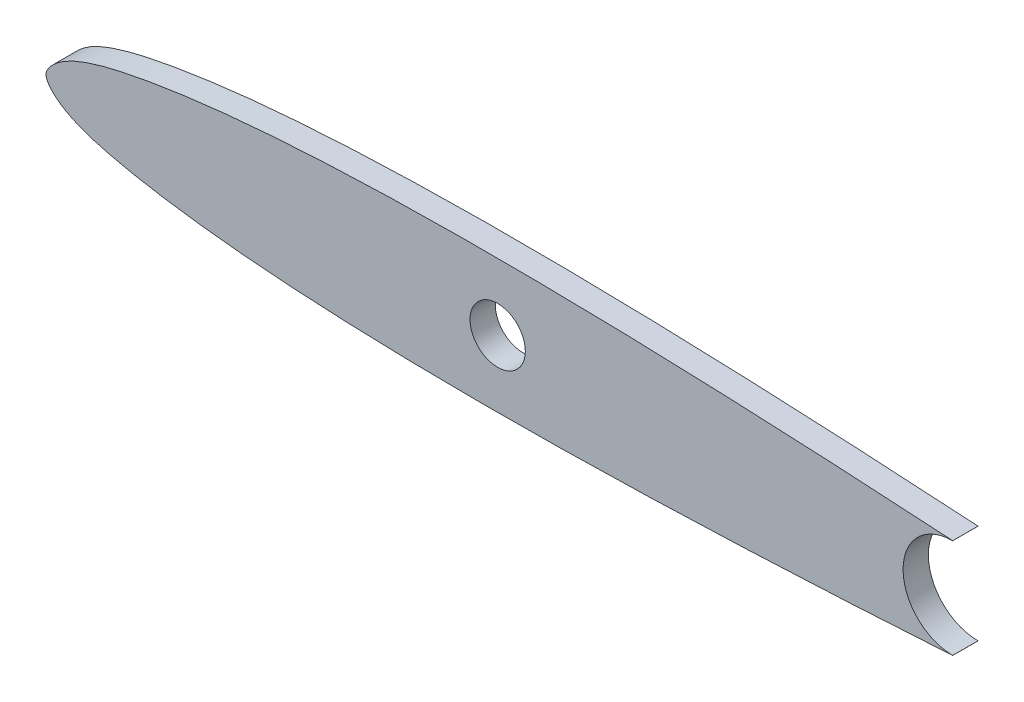
ISO-10303-21;
HEADER;
FILE_DESCRIPTION(('STEP AP214'),'2;1');
FILE_NAME('part.step','',(''),(''),'','','');
FILE_SCHEMA(('AUTOMOTIVE_DESIGN { 1 0 10303 214 1 1 1 1 }'));
ENDSEC;
DATA;
#1=APPLICATION_CONTEXT('core data for automotive mechanical design processes');
#2=APPLICATION_PROTOCOL_DEFINITION('international standard','automotive_design',2000,#1);
#3=PRODUCT_CONTEXT('',#1,'mechanical');
#4=PRODUCT('Part','Part','',(#3));
#5=PRODUCT_RELATED_PRODUCT_CATEGORY('part','',(#4));
#6=PRODUCT_DEFINITION_FORMATION('','',#4);
#7=PRODUCT_DEFINITION_CONTEXT('part definition',#1,'design');
#8=PRODUCT_DEFINITION('design','',#6,#7);
#9=PRODUCT_DEFINITION_SHAPE('','',#8);
#10=(LENGTH_UNIT() NAMED_UNIT(*) SI_UNIT(.MILLI.,.METRE.));
#11=(NAMED_UNIT(*) PLANE_ANGLE_UNIT() SI_UNIT($,.RADIAN.));
#12=(NAMED_UNIT(*) SI_UNIT($,.STERADIAN.) SOLID_ANGLE_UNIT());
#13=UNCERTAINTY_MEASURE_WITH_UNIT(LENGTH_MEASURE(1.E-05),#10,'distance_accuracy_value','');
#14=(GEOMETRIC_REPRESENTATION_CONTEXT(3) GLOBAL_UNCERTAINTY_ASSIGNED_CONTEXT((#13)) GLOBAL_UNIT_ASSIGNED_CONTEXT((#10,
#11,#12)) REPRESENTATION_CONTEXT('',''));
#15=CARTESIAN_POINT('',(0.,0.,0.));
#16=DIRECTION('',(0.,0.,1.));
#17=DIRECTION('',(1.,0.,0.));
#18=AXIS2_PLACEMENT_3D('',#15,#16,#17);
#19=CARTESIAN_POINT('',(133.858,0.,2.286));
#20=CARTESIAN_POINT('',(133.858000000006,0.025572352081566,2.286));
#21=CARTESIAN_POINT('',(132.635239994895,0.127315723893167,2.286));
#22=CARTESIAN_POINT('',(131.381173106276,0.339626329426729,2.286));
#23=CARTESIAN_POINT('',(128.334953603946,0.665115733575434,2.286));
#24=CARTESIAN_POINT('',(124.592239149143,1.06914047249353,2.286));
#25=CARTESIAN_POINT('',(119.715507643787,1.54326007619425,2.286));
#26=CARTESIAN_POINT('',(113.989956530878,2.06648210627225,2.286));
#27=CARTESIAN_POINT('',(107.440636520153,2.62870278752321,2.286));
#28=CARTESIAN_POINT('',(100.204596194085,3.21347035648728,2.286));
#29=CARTESIAN_POINT('',(92.397202136374,3.79742729289213,2.286));
#30=CARTESIAN_POINT('',(84.1545880867161,4.36327057560728,2.286));
#31=CARTESIAN_POINT('',(75.6171940837196,4.88496292152431,2.286));
#32=CARTESIAN_POINT('',(66.9311998096909,5.34041153125693,2.286));
#33=CARTESIAN_POINT('',(58.2449138974531,5.70254244928646,2.286));
#34=CARTESIAN_POINT('',(51.0726177823776,5.91173943716512,2.286));
#35=CARTESIAN_POINT('',(45.4463596762667,6.0078430649406,2.286));
#36=CARTESIAN_POINT('',(41.3532701766978,6.04194979941246,2.286));
#37=CARTESIAN_POINT('',(37.369416298685,6.03718550610148,2.286));
#38=CARTESIAN_POINT('',(33.5118372205296,5.98590262113425,2.286));
#39=CARTESIAN_POINT('',(29.7973522340072,5.89588412288079,2.286));
#40=CARTESIAN_POINT('',(26.2421744999696,5.75993669881171,2.286));
#41=CARTESIAN_POINT('',(22.8612457530526,5.58301050883047,2.286));
#42=CARTESIAN_POINT('',(19.6685964297222,5.36098124440595,2.286));
#43=CARTESIAN_POINT('',(16.6777641276208,5.09760583245151,2.286));
#44=CARTESIAN_POINT('',(13.9025226364826,4.79057825251858,2.286));
#45=CARTESIAN_POINT('',(11.3544396865246,4.44575169458695,2.286));
#46=CARTESIAN_POINT('',(9.04347840167528,4.0720155242444,2.286));
#47=CARTESIAN_POINT('',(6.97926327189238,3.67104369469383,2.286));
#48=CARTESIAN_POINT('',(5.16849998283899,3.24422580466831,2.286));
#49=CARTESIAN_POINT('',(3.61976357763527,2.77718790177075,2.286));
#50=CARTESIAN_POINT('',(2.33641563214279,2.26127952664189,2.286));
#51=CARTESIAN_POINT('',(1.33019865423671,1.69204562324609,2.286));
#52=CARTESIAN_POINT('',(0.606605893496202,1.09763980354831,2.286));
#53=CARTESIAN_POINT('',(0.154717171863237,0.552843267655984,2.286));
#54=CARTESIAN_POINT('',(-0.0633102416850822,3.01443884090045E-08,2.286));
#55=CARTESIAN_POINT('',(0.154717171614367,-0.552843207465403,2.286));
#56=CARTESIAN_POINT('',(0.606605893002044,-1.09763974356111,2.286));
#57=CARTESIAN_POINT('',(1.33019865347502,-1.69204556358469,2.286));
#58=CARTESIAN_POINT('',(2.33641563112479,-2.26127946743343,2.286));
#59=CARTESIAN_POINT('',(3.61976357638505,-2.77718784314004,2.286));
#60=CARTESIAN_POINT('',(5.16849998137848,-3.24422574673481,2.286));
#61=CARTESIAN_POINT('',(6.97926327023977,-3.67104363757551,2.286));
#62=CARTESIAN_POINT('',(9.04347839984211,-4.07201546805534,2.286));
#63=CARTESIAN_POINT('',(11.3544396845232,-4.44575163943824,2.286));
#64=CARTESIAN_POINT('',(13.902522634326,-4.79057819851697,2.286));
#65=CARTESIAN_POINT('',(16.677764125326,-5.09760577969925,2.286));
#66=CARTESIAN_POINT('',(19.6685964273089,-5.36098119300011,2.286));
#67=CARTESIAN_POINT('',(22.8612457505392,-5.5830104588619,2.286));
#68=CARTESIAN_POINT('',(26.2421744973766,-5.75993665036517,2.286));
#69=CARTESIAN_POINT('',(29.7973522313529,-5.89588407603472,2.286));
#70=CARTESIAN_POINT('',(33.5118372178349,-5.98590257596037,2.286));
#71=CARTESIAN_POINT('',(37.3694162959672,-6.0371854626642,2.286));
#72=CARTESIAN_POINT('',(41.3532701739779,-6.04194975776863,2.286));
#73=CARTESIAN_POINT('',(45.4463596735621,-6.00784302513942,2.286));
#74=CARTESIAN_POINT('',(51.0726177797163,-5.91173939989676,2.286));
#75=CARTESIAN_POINT('',(58.2449138948859,-5.70254241524693,2.286));
#76=CARTESIAN_POINT('',(66.9311998072867,-5.34041150112779,2.286));
#77=CARTESIAN_POINT('',(75.6171940815205,-4.88496289530543,2.286));
#78=CARTESIAN_POINT('',(84.1545880847518,-4.36327055323178,2.286));
#79=CARTESIAN_POINT('',(92.3972021346645,-3.79742727422729,2.286));
#80=CARTESIAN_POINT('',(100.204596192638,-3.21347034133717,2.286));
#81=CARTESIAN_POINT('',(107.44063651897,-2.62870277563063,2.286));
#82=CARTESIAN_POINT('',(113.989956529947,-2.06648209732804,2.286));
#83=CARTESIAN_POINT('',(119.715507643092,-1.54326006982758,2.286));
#84=CARTESIAN_POINT('',(124.592239148662,-1.06914046832227,2.286));
#85=CARTESIAN_POINT('',(128.334953603647,-0.665115731089063,2.286));
#86=CARTESIAN_POINT('',(131.381173106123,-0.339626328311714,2.286));
#87=CARTESIAN_POINT('',(132.635239994838,-0.127315723342702,2.286));
#88=CARTESIAN_POINT('',(133.857999999994,-0.0255723520815676,2.286));
#89=CARTESIAN_POINT('',(133.858,0.,2.286));
#90=B_SPLINE_CURVE_WITH_KNOTS('',3,(#19,#20,#21,#22,#23,#24,#25,#26,#27,#28,#29,#30,#31,#32,#33,
#34,#35,#36,#37,#38,#39,#40,#41,#42,#43,#44,#45,#46,#47,#48,#49,#50,#51,#52,#53,#54,#55,#56,#57,
#58,#59,#60,#61,#62,#63,#64,#65,#66,#67,#68,#69,#70,#71,#72,#73,#74,#75,#76,#77,#78,#79,#80,#81,
#82,#83,#84,#85,#86,#87,#88,#89),.UNSPECIFIED.,.T.,.F.,(4,1,1,1,1,1,1,1,1,1,1,1,1,1,1,1,1,1,1,1,
1,1,1,1,1,1,1,1,1,1,1,1,1,1,1,1,1,1,1,1,1,1,1,1,1,1,1,1,1,1,1,1,1,1,1,1,1,1,1,1,1,1,1,1,1,1,1,1,
4),(0.,0.00213342749536812,0.00848815570874326,0.0189444871418497,0.033319113775561,
0.0513562940971698,0.0727560928984786,0.0971408174352606,0.124097488782512,0.153162556777752,
0.183833917661664,0.21558937445911,0.247878194577004,0.280150867864074,0.311860397032406,
0.327332942728477,0.342462846119516,0.35718710244681,0.371448118351621,0.385183441042633,
0.398331272584713,0.410844637191414,0.422672607167312,0.433769314473499,0.444090175228778,
0.453589411782157,0.462240439844477,0.470010037325291,0.476870984677,0.482833353063501,
0.487908551351284,0.492155163583175,0.495592273393841,0.498196358984712,0.5,0.501803641015288,
0.504407726606159,0.507844836416825,0.512091448648716,0.517166646936499,0.523129015323001,
0.529989962674709,0.537759560155523,0.546410588217844,0.555909824771222,0.566230685526501,
0.577327392832688,0.589155362808586,0.601668727415287,0.614816558957367,0.628551881648379,
0.64281289755319,0.657537153880484,0.672667057271523,0.688139602967594,0.719849132135926,
0.752121805422996,0.78441062554089,0.816166082338336,0.846837443222248,0.875902511217488,
0.902859182564739,0.927243907101521,0.94864370590283,0.966680886224439,0.98105551285815,
0.991511844291257,0.997866572504632,1.),.UNSPECIFIED.);
#91=DIRECTION('',(0.,0.,-1.));
#92=VECTOR('',#91,1.);
#93=SURFACE_OF_LINEAR_EXTRUSION('',#90,#92);
#94=DIRECTION('',(0.,0.,-1.));
#95=VECTOR('',#94,1.);
#96=CARTESIAN_POINT('',(81.9608349526856,-4.4927640341266,2.286));
#97=LINE('',#96,#95);
#98=CARTESIAN_POINT('',(81.9608349526856,-4.4927640328996,2.286));
#99=VERTEX_POINT('',#98);
#100=CARTESIAN_POINT('',(81.9608349526856,-4.4927640328996,0.));
#101=VERTEX_POINT('',#100);
#102=EDGE_CURVE('E55',#99,#101,#97,.T.);
#103=ORIENTED_EDGE('',*,*,#102,.F.);
#104=CARTESIAN_POINT('',(81.9608349526856,4.49276405638983,2.286));
#105=VERTEX_POINT('',#104);
#106=EDGE_CURVE('E40',#105,#99,#90,.T.);
#107=ORIENTED_EDGE('',*,*,#106,.F.);
#108=DIRECTION('',(0.,0.,-1.));
#109=VECTOR('',#108,1.);
#110=CARTESIAN_POINT('',(81.9608349526856,4.49276405761683,2.286));
#111=LINE('',#110,#109);
#112=CARTESIAN_POINT('',(81.9608349526856,4.49276405638983,0.));
#113=VERTEX_POINT('',#112);
#114=EDGE_CURVE('E97',#113,#105,#111,.F.);
#115=ORIENTED_EDGE('',*,*,#114,.F.);
#116=CARTESIAN_POINT('',(133.858,0.,0.));
#117=CARTESIAN_POINT('',(133.858000000006,0.025572352081566,0.));
#118=CARTESIAN_POINT('',(132.635239994895,0.127315723893167,0.));
#119=CARTESIAN_POINT('',(131.381173106276,0.339626329426729,0.));
#120=CARTESIAN_POINT('',(128.334953603946,0.665115733575434,0.));
#121=CARTESIAN_POINT('',(124.592239149143,1.06914047249353,0.));
#122=CARTESIAN_POINT('',(119.715507643787,1.54326007619425,0.));
#123=CARTESIAN_POINT('',(113.989956530878,2.06648210627225,0.));
#124=CARTESIAN_POINT('',(107.440636520153,2.62870278752321,0.));
#125=CARTESIAN_POINT('',(100.204596194085,3.21347035648728,0.));
#126=CARTESIAN_POINT('',(92.397202136374,3.79742729289213,0.));
#127=CARTESIAN_POINT('',(84.1545880867161,4.36327057560728,0.));
#128=CARTESIAN_POINT('',(75.6171940837196,4.88496292152431,0.));
#129=CARTESIAN_POINT('',(66.9311998096909,5.34041153125693,0.));
#130=CARTESIAN_POINT('',(58.2449138974531,5.70254244928646,0.));
#131=CARTESIAN_POINT('',(51.0726177823776,5.91173943716512,0.));
#132=CARTESIAN_POINT('',(45.4463596762667,6.0078430649406,0.));
#133=CARTESIAN_POINT('',(41.3532701766978,6.04194979941246,0.));
#134=CARTESIAN_POINT('',(37.369416298685,6.03718550610148,0.));
#135=CARTESIAN_POINT('',(33.5118372205296,5.98590262113425,0.));
#136=CARTESIAN_POINT('',(29.7973522340072,5.89588412288079,0.));
#137=CARTESIAN_POINT('',(26.2421744999696,5.75993669881171,0.));
#138=CARTESIAN_POINT('',(22.8612457530526,5.58301050883047,0.));
#139=CARTESIAN_POINT('',(19.6685964297222,5.36098124440595,0.));
#140=CARTESIAN_POINT('',(16.6777641276208,5.09760583245151,0.));
#141=CARTESIAN_POINT('',(13.9025226364826,4.79057825251858,0.));
#142=CARTESIAN_POINT('',(11.3544396865246,4.44575169458695,0.));
#143=CARTESIAN_POINT('',(9.04347840167528,4.0720155242444,0.));
#144=CARTESIAN_POINT('',(6.97926327189238,3.67104369469383,0.));
#145=CARTESIAN_POINT('',(5.16849998283899,3.24422580466831,0.));
#146=CARTESIAN_POINT('',(3.61976357763527,2.77718790177075,0.));
#147=CARTESIAN_POINT('',(2.33641563214279,2.26127952664189,0.));
#148=CARTESIAN_POINT('',(1.33019865423671,1.69204562324609,0.));
#149=CARTESIAN_POINT('',(0.606605893496202,1.09763980354831,0.));
#150=CARTESIAN_POINT('',(0.154717171863237,0.552843267655984,0.));
#151=CARTESIAN_POINT('',(-0.0633102416850822,3.01443884090045E-08,0.));
#152=CARTESIAN_POINT('',(0.154717171614367,-0.552843207465403,0.));
#153=CARTESIAN_POINT('',(0.606605893002044,-1.09763974356111,0.));
#154=CARTESIAN_POINT('',(1.33019865347502,-1.69204556358469,0.));
#155=CARTESIAN_POINT('',(2.33641563112479,-2.26127946743343,0.));
#156=CARTESIAN_POINT('',(3.61976357638505,-2.77718784314004,0.));
#157=CARTESIAN_POINT('',(5.16849998137848,-3.24422574673481,0.));
#158=CARTESIAN_POINT('',(6.97926327023977,-3.67104363757551,0.));
#159=CARTESIAN_POINT('',(9.04347839984211,-4.07201546805534,0.));
#160=CARTESIAN_POINT('',(11.3544396845232,-4.44575163943824,0.));
#161=CARTESIAN_POINT('',(13.902522634326,-4.79057819851697,0.));
#162=CARTESIAN_POINT('',(16.677764125326,-5.09760577969925,0.));
#163=CARTESIAN_POINT('',(19.6685964273089,-5.36098119300011,0.));
#164=CARTESIAN_POINT('',(22.8612457505392,-5.5830104588619,0.));
#165=CARTESIAN_POINT('',(26.2421744973766,-5.75993665036517,0.));
#166=CARTESIAN_POINT('',(29.7973522313529,-5.89588407603472,0.));
#167=CARTESIAN_POINT('',(33.5118372178349,-5.98590257596037,0.));
#168=CARTESIAN_POINT('',(37.3694162959672,-6.0371854626642,0.));
#169=CARTESIAN_POINT('',(41.3532701739779,-6.04194975776863,0.));
#170=CARTESIAN_POINT('',(45.4463596735621,-6.00784302513942,0.));
#171=CARTESIAN_POINT('',(51.0726177797163,-5.91173939989676,0.));
#172=CARTESIAN_POINT('',(58.2449138948859,-5.70254241524693,0.));
#173=CARTESIAN_POINT('',(66.9311998072867,-5.34041150112779,0.));
#174=CARTESIAN_POINT('',(75.6171940815205,-4.88496289530543,0.));
#175=CARTESIAN_POINT('',(84.1545880847518,-4.36327055323178,0.));
#176=CARTESIAN_POINT('',(92.3972021346645,-3.79742727422729,0.));
#177=CARTESIAN_POINT('',(100.204596192638,-3.21347034133717,0.));
#178=CARTESIAN_POINT('',(107.44063651897,-2.62870277563063,0.));
#179=CARTESIAN_POINT('',(113.989956529947,-2.06648209732804,0.));
#180=CARTESIAN_POINT('',(119.715507643092,-1.54326006982758,0.));
#181=CARTESIAN_POINT('',(124.592239148662,-1.06914046832227,0.));
#182=CARTESIAN_POINT('',(128.334953603647,-0.665115731089063,0.));
#183=CARTESIAN_POINT('',(131.381173106123,-0.339626328311714,0.));
#184=CARTESIAN_POINT('',(132.635239994838,-0.127315723342702,0.));
#185=CARTESIAN_POINT('',(133.857999999994,-0.0255723520815676,0.));
#186=CARTESIAN_POINT('',(133.858,0.,0.));
#187=B_SPLINE_CURVE_WITH_KNOTS('',3,(#116,#117,#118,#119,#120,#121,#122,#123,#124,#125,#126,
#127,#128,#129,#130,#131,#132,#133,#134,#135,#136,#137,#138,#139,#140,#141,#142,#143,#144,#145,
#146,#147,#148,#149,#150,#151,#152,#153,#154,#155,#156,#157,#158,#159,#160,#161,#162,#163,#164,
#165,#166,#167,#168,#169,#170,#171,#172,#173,#174,#175,#176,#177,#178,#179,#180,#181,#182,#183,
#184,#185,#186),.UNSPECIFIED.,.T.,.F.,(4,1,1,1,1,1,1,1,1,1,1,1,1,1,1,1,1,1,1,1,1,1,1,1,1,1,1,1,
1,1,1,1,1,1,1,1,1,1,1,1,1,1,1,1,1,1,1,1,1,1,1,1,1,1,1,1,1,1,1,1,1,1,1,1,1,1,1,1,4),(0.,
0.00213342749536812,0.00848815570874326,0.0189444871418497,0.033319113775561,0.0513562940971698,
0.0727560928984786,0.0971408174352606,0.124097488782512,0.153162556777752,0.183833917661664,
0.21558937445911,0.247878194577004,0.280150867864074,0.311860397032406,0.327332942728477,
0.342462846119516,0.35718710244681,0.371448118351621,0.385183441042633,0.398331272584713,
0.410844637191414,0.422672607167312,0.433769314473499,0.444090175228778,0.453589411782157,
0.462240439844477,0.470010037325291,0.476870984677,0.482833353063501,0.487908551351284,
0.492155163583175,0.495592273393841,0.498196358984712,0.5,0.501803641015288,0.504407726606159,
0.507844836416825,0.512091448648716,0.517166646936499,0.523129015323001,0.529989962674709,
0.537759560155523,0.546410588217844,0.555909824771222,0.566230685526501,0.577327392832688,
0.589155362808586,0.601668727415287,0.614816558957367,0.628551881648379,0.64281289755319,
0.657537153880484,0.672667057271523,0.688139602967594,0.719849132135926,0.752121805422996,
0.78441062554089,0.816166082338336,0.846837443222248,0.875902511217488,0.902859182564739,
0.927243907101521,0.94864370590283,0.966680886224439,0.98105551285815,0.991511844291257,
0.997866572504632,1.),.UNSPECIFIED.);
#188=EDGE_CURVE('E100',#113,#101,#187,.T.);
#189=ORIENTED_EDGE('',*,*,#188,.T.);
#190=EDGE_LOOP('',(#103,#107,#115,#189));
#191=FACE_BOUND('',#190,.T.);
#192=ADVANCED_FACE('F32',(#191),#93,.F.);
#193=CARTESIAN_POINT('',(0.,3.0130156970331E-08,2.286));
#194=DIRECTION('',(0.,0.,-1.));
#195=DIRECTION('',(-1.,0.,0.));
#196=AXIS2_PLACEMENT_3D('',#193,#194,#195);
#197=PLANE('',#196);
#198=CARTESIAN_POINT('',(40.82669,0.,2.286));
#199=DIRECTION('',(0.,0.,1.));
#200=DIRECTION('',(1.,0.,0.));
#201=AXIS2_PLACEMENT_3D('',#198,#199,#200);
#202=CIRCLE('',#201,2.499995);
#203=CARTESIAN_POINT('',(43.326685,0.,2.286));
#204=VERTEX_POINT('',#203);
#205=EDGE_CURVE('E80',#204,#204,#202,.T.);
#206=ORIENTED_EDGE('',*,*,#205,.F.);
#207=EDGE_LOOP('',(#206));
#208=FACE_BOUND('',#207,.T.);
#209=DIRECTION('',(0.,1.,0.));
#210=VECTOR('',#209,1.);
#211=CARTESIAN_POINT('',(81.9608349526856,0.,2.286));
#212=LINE('',#211,#210);
#213=CARTESIAN_POINT('',(81.9608349526856,-4.48763797823478,2.286));
#214=VERTEX_POINT('',#213);
#215=EDGE_CURVE('E88',#99,#214,#212,.T.);
#216=ORIENTED_EDGE('',*,*,#215,.T.);
#217=CARTESIAN_POINT('',(81.9608349526856,0.,2.286));
#218=DIRECTION('',(0.,0.,1.));
#219=DIRECTION('',(1.,0.,0.));
#220=AXIS2_PLACEMENT_3D('',#217,#218,#219);
#221=CIRCLE('',#220,4.48763797823477);
#222=CARTESIAN_POINT('',(81.9608349526856,4.48763797823476,2.286));
#223=VERTEX_POINT('',#222);
#224=EDGE_CURVE('E78',#223,#214,#221,.T.);
#225=ORIENTED_EDGE('',*,*,#224,.F.);
#226=DIRECTION('',(0.,1.,0.));
#227=VECTOR('',#226,1.);
#228=CARTESIAN_POINT('',(81.9608349526856,0.,2.286));
#229=LINE('',#228,#227);
#230=EDGE_CURVE('E92',#223,#105,#229,.T.);
#231=ORIENTED_EDGE('',*,*,#230,.T.);
#232=ORIENTED_EDGE('',*,*,#106,.T.);
#233=EDGE_LOOP('',(#216,#225,#231,#232));
#234=FACE_BOUND('',#233,.T.);
#235=ADVANCED_FACE('F120',(#208,#234),#197,.F.);
#236=CARTESIAN_POINT('',(0.,3.0130156970331E-08,0.));
#237=DIRECTION('',(0.,0.,-1.));
#238=DIRECTION('',(-1.,0.,0.));
#239=AXIS2_PLACEMENT_3D('',#236,#237,#238);
#240=PLANE('',#239);
#241=CARTESIAN_POINT('',(40.82669,0.,0.));
#242=DIRECTION('',(0.,0.,1.));
#243=DIRECTION('',(1.,0.,0.));
#244=AXIS2_PLACEMENT_3D('',#241,#242,#243);
#245=CIRCLE('',#244,2.499995);
#246=CARTESIAN_POINT('',(43.326685,0.,0.));
#247=VERTEX_POINT('',#246);
#248=EDGE_CURVE('E99',#247,#247,#245,.T.);
#249=ORIENTED_EDGE('',*,*,#248,.T.);
#250=EDGE_LOOP('',(#249));
#251=FACE_BOUND('',#250,.T.);
#252=CARTESIAN_POINT('',(81.9608349526856,0.,0.));
#253=DIRECTION('',(0.,0.,1.));
#254=DIRECTION('',(1.,0.,0.));
#255=AXIS2_PLACEMENT_3D('',#252,#253,#254);
#256=CIRCLE('',#255,4.48763797823477);
#257=CARTESIAN_POINT('',(81.9608349526856,4.48763797823476,0.));
#258=VERTEX_POINT('',#257);
#259=CARTESIAN_POINT('',(81.9608349526856,-4.48763797823478,0.));
#260=VERTEX_POINT('',#259);
#261=EDGE_CURVE('E47',#258,#260,#256,.T.);
#262=ORIENTED_EDGE('',*,*,#261,.T.);
#263=DIRECTION('',(0.,-1.,0.));
#264=VECTOR('',#263,1.);
#265=CARTESIAN_POINT('',(81.9608349526856,3.0130156970331E-08,0.));
#266=LINE('',#265,#264);
#267=EDGE_CURVE('E11',#260,#101,#266,.T.);
#268=ORIENTED_EDGE('',*,*,#267,.T.);
#269=ORIENTED_EDGE('',*,*,#188,.F.);
#270=DIRECTION('',(0.,1.,0.));
#271=VECTOR('',#270,1.);
#272=CARTESIAN_POINT('',(81.9608349526856,0.,0.));
#273=LINE('',#272,#271);
#274=EDGE_CURVE('E85',#258,#113,#273,.T.);
#275=ORIENTED_EDGE('',*,*,#274,.F.);
#276=EDGE_LOOP('',(#262,#268,#269,#275));
#277=FACE_BOUND('',#276,.T.);
#278=ADVANCED_FACE('F84',(#251,#277),#240,.T.);
#279=CARTESIAN_POINT('',(81.9608349526856,0.,0.));
#280=DIRECTION('',(1.,0.,0.));
#281=DIRECTION('',(0.,0.,-1.));
#282=AXIS2_PLACEMENT_3D('',#279,#280,#281);
#283=PLANE('',#282);
#284=ORIENTED_EDGE('',*,*,#102,.T.);
#285=ORIENTED_EDGE('',*,*,#267,.F.);
#286=DIRECTION('',(0.,0.,1.));
#287=VECTOR('',#286,1.);
#288=CARTESIAN_POINT('',(81.9608349526856,-4.48763797823478,0.));
#289=LINE('',#288,#287);
#290=EDGE_CURVE('E71',#260,#214,#289,.T.);
#291=ORIENTED_EDGE('',*,*,#290,.T.);
#292=ORIENTED_EDGE('',*,*,#215,.F.);
#293=EDGE_LOOP('',(#284,#285,#291,#292));
#294=FACE_BOUND('',#293,.T.);
#295=ADVANCED_FACE('F70',(#294),#283,.T.);
#296=CARTESIAN_POINT('',(81.9608349526856,0.,0.));
#297=DIRECTION('',(1.,0.,0.));
#298=DIRECTION('',(0.,0.,-1.));
#299=AXIS2_PLACEMENT_3D('',#296,#297,#298);
#300=PLANE('',#299);
#301=ORIENTED_EDGE('',*,*,#114,.T.);
#302=ORIENTED_EDGE('',*,*,#230,.F.);
#303=DIRECTION('',(0.,0.,1.));
#304=VECTOR('',#303,1.);
#305=CARTESIAN_POINT('',(81.9608349526856,4.48763797823476,0.));
#306=LINE('',#305,#304);
#307=EDGE_CURVE('E81',#258,#223,#306,.T.);
#308=ORIENTED_EDGE('',*,*,#307,.F.);
#309=ORIENTED_EDGE('',*,*,#274,.T.);
#310=EDGE_LOOP('',(#301,#302,#308,#309));
#311=FACE_BOUND('',#310,.T.);
#312=ADVANCED_FACE('F118',(#311),#300,.T.);
#313=CARTESIAN_POINT('',(81.9608349526856,0.,0.));
#314=DIRECTION('',(0.,0.,1.));
#315=DIRECTION('',(1.,0.,0.));
#316=AXIS2_PLACEMENT_3D('',#313,#314,#315);
#317=CYLINDRICAL_SURFACE('',#316,4.48763797823477);
#318=ORIENTED_EDGE('',*,*,#224,.T.);
#319=ORIENTED_EDGE('',*,*,#290,.F.);
#320=ORIENTED_EDGE('',*,*,#261,.F.);
#321=ORIENTED_EDGE('',*,*,#307,.T.);
#322=EDGE_LOOP('',(#318,#319,#320,#321));
#323=FACE_BOUND('',#322,.T.);
#324=ADVANCED_FACE('F76',(#323),#317,.F.);
#325=CARTESIAN_POINT('',(40.82669,0.,0.));
#326=DIRECTION('',(0.,0.,1.));
#327=DIRECTION('',(1.,0.,0.));
#328=AXIS2_PLACEMENT_3D('',#325,#326,#327);
#329=CYLINDRICAL_SURFACE('',#328,2.499995);
#330=ORIENTED_EDGE('',*,*,#248,.F.);
#331=EDGE_LOOP('',(#330));
#332=FACE_BOUND('',#331,.T.);
#333=ORIENTED_EDGE('',*,*,#205,.T.);
#334=EDGE_LOOP('',(#333));
#335=FACE_BOUND('',#334,.T.);
#336=ADVANCED_FACE('F135',(#332,#335),#329,.F.);
#337=CLOSED_SHELL('',(#192,#235,#278,#295,#312,#324,#336));
#338=MANIFOLD_SOLID_BREP('B2',#337);
#339=ADVANCED_BREP_SHAPE_REPRESENTATION('',(#18,#338),#14);
#340=SHAPE_DEFINITION_REPRESENTATION(#9,#339);
ENDSEC;
END-ISO-10303-21;
